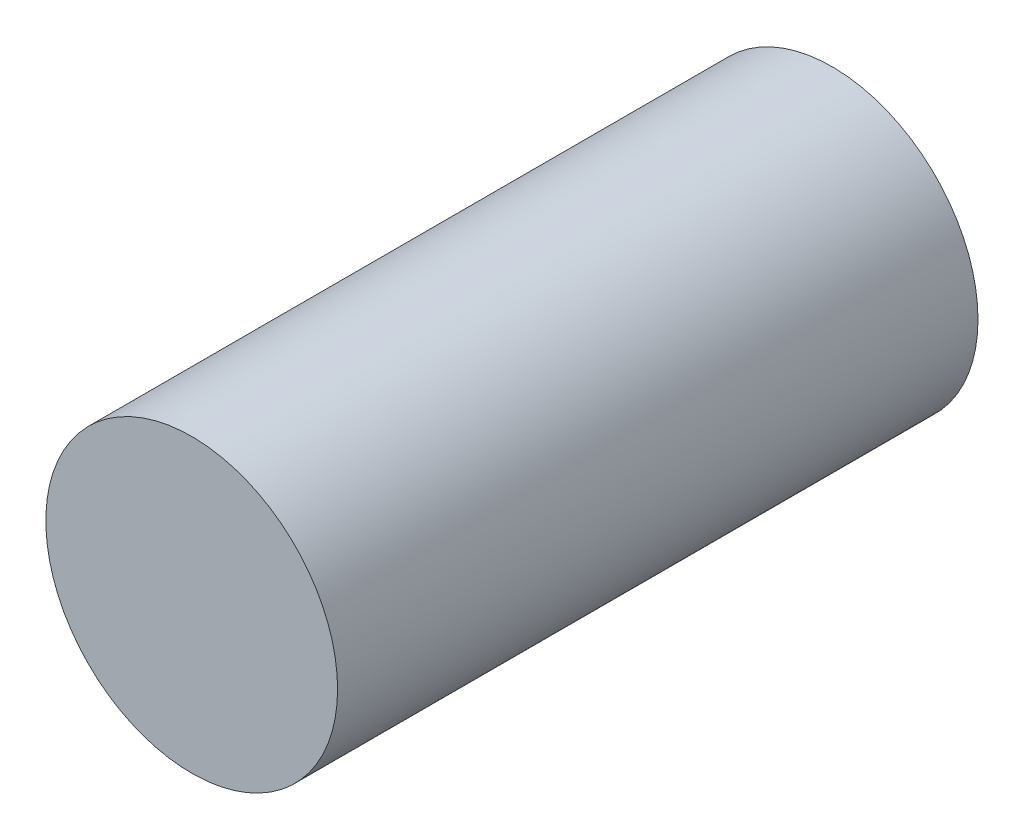
ISO-10303-21;
HEADER;
FILE_DESCRIPTION(('STEP AP214'),'2;1');
FILE_NAME('part.step','',(''),(''),'','','');
FILE_SCHEMA(('AUTOMOTIVE_DESIGN { 1 0 10303 214 1 1 1 1 }'));
ENDSEC;
DATA;
#1=APPLICATION_CONTEXT('core data for automotive mechanical design processes');
#2=APPLICATION_PROTOCOL_DEFINITION('international standard','automotive_design',2000,#1);
#3=PRODUCT_CONTEXT('',#1,'mechanical');
#4=PRODUCT('Part','Part','',(#3));
#5=PRODUCT_RELATED_PRODUCT_CATEGORY('part','',(#4));
#6=PRODUCT_DEFINITION_FORMATION('','',#4);
#7=PRODUCT_DEFINITION_CONTEXT('part definition',#1,'design');
#8=PRODUCT_DEFINITION('design','',#6,#7);
#9=PRODUCT_DEFINITION_SHAPE('','',#8);
#10=(LENGTH_UNIT() NAMED_UNIT(*) SI_UNIT(.MILLI.,.METRE.));
#11=(NAMED_UNIT(*) PLANE_ANGLE_UNIT() SI_UNIT($,.RADIAN.));
#12=(NAMED_UNIT(*) SI_UNIT($,.STERADIAN.) SOLID_ANGLE_UNIT());
#13=UNCERTAINTY_MEASURE_WITH_UNIT(LENGTH_MEASURE(1.E-05),#10,'distance_accuracy_value','');
#14=(GEOMETRIC_REPRESENTATION_CONTEXT(3) GLOBAL_UNCERTAINTY_ASSIGNED_CONTEXT((#13)) GLOBAL_UNIT_ASSIGNED_CONTEXT((#10,
#11,#12)) REPRESENTATION_CONTEXT('',''));
#15=CARTESIAN_POINT('',(0.,0.,0.));
#16=DIRECTION('',(0.,0.,1.));
#17=DIRECTION('',(1.,0.,0.));
#18=AXIS2_PLACEMENT_3D('',#15,#16,#17);
#19=CARTESIAN_POINT('',(-2.54,-1.27,0.1));
#20=DIRECTION('',(0.,0.,1.));
#21=DIRECTION('',(1.,0.,0.));
#22=AXIS2_PLACEMENT_3D('',#19,#20,#21);
#23=PLANE('',#22);
#24=CARTESIAN_POINT('',(-2.54,-1.27,0.1));
#25=DIRECTION('',(0.,0.,1.));
#26=DIRECTION('',(1.,0.,0.));
#27=AXIS2_PLACEMENT_3D('',#24,#25,#26);
#28=CIRCLE('',#27,0.41);
#29=CARTESIAN_POINT('',(-2.13,-1.27,0.1));
#30=VERTEX_POINT('',#29);
#31=EDGE_CURVE('E17',#30,#30,#28,.F.);
#32=ORIENTED_EDGE('',*,*,#31,.F.);
#33=EDGE_LOOP('',(#32));
#34=FACE_BOUND('',#33,.T.);
#35=ADVANCED_FACE('F14',(#34),#23,.T.);
#36=CARTESIAN_POINT('',(-2.54,-1.27,-1.7));
#37=DIRECTION('',(0.,0.,1.));
#38=DIRECTION('',(1.,0.,0.));
#39=AXIS2_PLACEMENT_3D('',#36,#37,#38);
#40=PLANE('',#39);
#41=CARTESIAN_POINT('',(-2.54,-1.27,-1.7));
#42=DIRECTION('',(0.,0.,1.));
#43=DIRECTION('',(1.,0.,0.));
#44=AXIS2_PLACEMENT_3D('',#41,#42,#43);
#45=CIRCLE('',#44,0.41);
#46=CARTESIAN_POINT('',(-2.13,-1.27,-1.7));
#47=VERTEX_POINT('',#46);
#48=EDGE_CURVE('E10',#47,#47,#45,.T.);
#49=ORIENTED_EDGE('',*,*,#48,.F.);
#50=EDGE_LOOP('',(#49));
#51=FACE_BOUND('',#50,.T.);
#52=ADVANCED_FACE('F29',(#51),#40,.F.);
#53=CARTESIAN_POINT('',(-2.54,-1.27,-1.7));
#54=DIRECTION('',(0.,0.,1.));
#55=DIRECTION('',(1.,0.,0.));
#56=AXIS2_PLACEMENT_3D('',#53,#54,#55);
#57=CYLINDRICAL_SURFACE('',#56,0.41);
#58=ORIENTED_EDGE('',*,*,#48,.T.);
#59=EDGE_LOOP('',(#58));
#60=FACE_BOUND('',#59,.T.);
#61=ORIENTED_EDGE('',*,*,#31,.T.);
#62=EDGE_LOOP('',(#61));
#63=FACE_BOUND('',#62,.T.);
#64=ADVANCED_FACE('F26',(#60,#63),#57,.T.);
#65=CLOSED_SHELL('',(#35,#52,#64));
#66=MANIFOLD_SOLID_BREP('B1',#65);
#67=ADVANCED_BREP_SHAPE_REPRESENTATION('',(#18,#66),#14);
#68=SHAPE_DEFINITION_REPRESENTATION(#9,#67);
ENDSEC;
END-ISO-10303-21;
